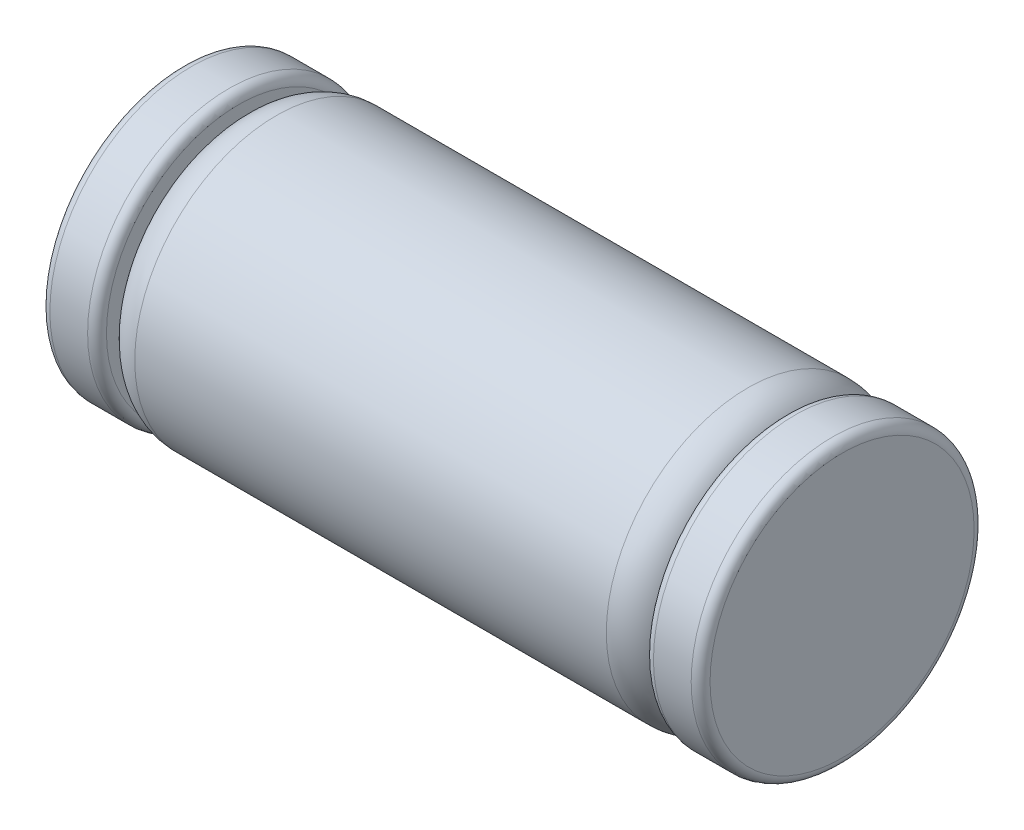
ISO-10303-21;
HEADER;
FILE_DESCRIPTION(('STEP AP214'),'2;1');
FILE_NAME('part.step','',(''),(''),'','','');
FILE_SCHEMA(('AUTOMOTIVE_DESIGN { 1 0 10303 214 1 1 1 1 }'));
ENDSEC;
DATA;
#1=APPLICATION_CONTEXT('core data for automotive mechanical design processes');
#2=APPLICATION_PROTOCOL_DEFINITION('international standard','automotive_design',2000,#1);
#3=PRODUCT_CONTEXT('',#1,'mechanical');
#4=PRODUCT('Part','Part','',(#3));
#5=PRODUCT_RELATED_PRODUCT_CATEGORY('part','',(#4));
#6=PRODUCT_DEFINITION_FORMATION('','',#4);
#7=PRODUCT_DEFINITION_CONTEXT('part definition',#1,'design');
#8=PRODUCT_DEFINITION('design','',#6,#7);
#9=PRODUCT_DEFINITION_SHAPE('','',#8);
#10=(LENGTH_UNIT() NAMED_UNIT(*) SI_UNIT(.MILLI.,.METRE.));
#11=(NAMED_UNIT(*) PLANE_ANGLE_UNIT() SI_UNIT($,.RADIAN.));
#12=(NAMED_UNIT(*) SI_UNIT($,.STERADIAN.) SOLID_ANGLE_UNIT());
#13=UNCERTAINTY_MEASURE_WITH_UNIT(LENGTH_MEASURE(1.E-05),#10,'distance_accuracy_value','');
#14=(GEOMETRIC_REPRESENTATION_CONTEXT(3) GLOBAL_UNCERTAINTY_ASSIGNED_CONTEXT((#13)) GLOBAL_UNIT_ASSIGNED_CONTEXT((#10,
#11,#12)) REPRESENTATION_CONTEXT('',''));
#15=CARTESIAN_POINT('',(0.,0.,0.));
#16=DIRECTION('',(0.,0.,1.));
#17=DIRECTION('',(1.,0.,0.));
#18=AXIS2_PLACEMENT_3D('',#15,#16,#17);
#19=CARTESIAN_POINT('',(-1.75,0.,0.));
#20=DIRECTION('',(-1.,0.,0.));
#21=DIRECTION('',(0.,0.,1.));
#22=AXIS2_PLACEMENT_3D('',#19,#20,#21);
#23=PLANE('',#22);
#24=CARTESIAN_POINT('',(-1.75,0.,0.));
#25=DIRECTION('',(1.,0.,0.));
#26=DIRECTION('',(0.,0.,-1.));
#27=AXIS2_PLACEMENT_3D('',#24,#25,#26);
#28=CIRCLE('',#27,0.7);
#29=CARTESIAN_POINT('',(-1.75,0.,-0.7));
#30=VERTEX_POINT('',#29);
#31=CARTESIAN_POINT('',(-1.75,0.,0.7));
#32=VERTEX_POINT('',#31);
#33=EDGE_CURVE('E70',#30,#32,#28,.T.);
#34=ORIENTED_EDGE('',*,*,#33,.F.);
#35=CARTESIAN_POINT('',(-1.75,0.,0.));
#36=DIRECTION('',(1.,0.,0.));
#37=DIRECTION('',(0.,0.,1.));
#38=AXIS2_PLACEMENT_3D('',#35,#36,#37);
#39=CIRCLE('',#38,0.7);
#40=EDGE_CURVE('E74',#32,#30,#39,.T.);
#41=ORIENTED_EDGE('',*,*,#40,.F.);
#42=EDGE_LOOP('',(#34,#41));
#43=FACE_BOUND('',#42,.T.);
#44=ADVANCED_FACE('F17',(#43),#23,.T.);
#45=CARTESIAN_POINT('',(1.75,0.,0.));
#46=DIRECTION('',(1.,0.,0.));
#47=DIRECTION('',(0.,0.,-1.));
#48=AXIS2_PLACEMENT_3D('',#45,#46,#47);
#49=PLANE('',#48);
#50=CARTESIAN_POINT('',(1.75,0.,0.));
#51=DIRECTION('',(-1.,0.,0.));
#52=DIRECTION('',(0.,0.,1.));
#53=AXIS2_PLACEMENT_3D('',#50,#51,#52);
#54=CIRCLE('',#53,0.7);
#55=CARTESIAN_POINT('',(1.75,0.,0.7));
#56=VERTEX_POINT('',#55);
#57=CARTESIAN_POINT('',(1.75,0.,-0.7));
#58=VERTEX_POINT('',#57);
#59=EDGE_CURVE('E80',#56,#58,#54,.T.);
#60=ORIENTED_EDGE('',*,*,#59,.F.);
#61=CARTESIAN_POINT('',(1.75,0.,0.));
#62=DIRECTION('',(-1.,0.,0.));
#63=DIRECTION('',(0.,0.,-1.));
#64=AXIS2_PLACEMENT_3D('',#61,#62,#63);
#65=CIRCLE('',#64,0.7);
#66=EDGE_CURVE('E114',#58,#56,#65,.T.);
#67=ORIENTED_EDGE('',*,*,#66,.F.);
#68=EDGE_LOOP('',(#60,#67));
#69=FACE_BOUND('',#68,.T.);
#70=ADVANCED_FACE('F99',(#69),#49,.T.);
#71=CARTESIAN_POINT('',(-1.7,0.,0.));
#72=DIRECTION('',(-1.,0.,0.));
#73=DIRECTION('',(0.,0.,1.));
#74=AXIS2_PLACEMENT_3D('',#71,#72,#73);
#75=TOROIDAL_SURFACE('',#74,0.7,0.05);
#76=CARTESIAN_POINT('',(-1.7,0.,0.));
#77=DIRECTION('',(-1.,0.,0.));
#78=DIRECTION('',(0.,0.,1.));
#79=AXIS2_PLACEMENT_3D('',#76,#77,#78);
#80=CIRCLE('',#79,0.75);
#81=CARTESIAN_POINT('',(-1.7,0.,0.75));
#82=VERTEX_POINT('',#81);
#83=EDGE_CURVE('E110',#82,#82,#80,.F.);
#84=ORIENTED_EDGE('',*,*,#83,.F.);
#85=EDGE_LOOP('',(#84));
#86=FACE_BOUND('',#85,.T.);
#87=ORIENTED_EDGE('',*,*,#40,.T.);
#88=ORIENTED_EDGE('',*,*,#33,.T.);
#89=EDGE_LOOP('',(#87,#88));
#90=FACE_BOUND('',#89,.T.);
#91=ADVANCED_FACE('F79',(#86,#90),#75,.T.);
#92=CARTESIAN_POINT('',(1.7,0.,0.));
#93=DIRECTION('',(-1.,0.,0.));
#94=DIRECTION('',(0.,0.,1.));
#95=AXIS2_PLACEMENT_3D('',#92,#93,#94);
#96=TOROIDAL_SURFACE('',#95,0.7,0.05);
#97=ORIENTED_EDGE('',*,*,#59,.T.);
#98=ORIENTED_EDGE('',*,*,#66,.T.);
#99=EDGE_LOOP('',(#97,#98));
#100=FACE_BOUND('',#99,.T.);
#101=CARTESIAN_POINT('',(1.7,0.,0.));
#102=DIRECTION('',(-1.,0.,0.));
#103=DIRECTION('',(0.,0.,1.));
#104=AXIS2_PLACEMENT_3D('',#101,#102,#103);
#105=CIRCLE('',#104,0.75);
#106=CARTESIAN_POINT('',(1.7,0.,0.75));
#107=VERTEX_POINT('',#106);
#108=EDGE_CURVE('E113',#107,#107,#105,.T.);
#109=ORIENTED_EDGE('',*,*,#108,.F.);
#110=EDGE_LOOP('',(#109));
#111=FACE_BOUND('',#110,.T.);
#112=ADVANCED_FACE('F98',(#100,#111),#96,.T.);
#113=CARTESIAN_POINT('',(-1.75,0.,0.));
#114=DIRECTION('',(-1.,0.,0.));
#115=DIRECTION('',(0.,0.,1.));
#116=AXIS2_PLACEMENT_3D('',#113,#114,#115);
#117=CYLINDRICAL_SURFACE('',#116,0.75);
#118=CARTESIAN_POINT('',(-1.5,0.,0.));
#119=DIRECTION('',(-1.,0.,0.));
#120=DIRECTION('',(0.,0.,1.));
#121=AXIS2_PLACEMENT_3D('',#118,#119,#120);
#122=CIRCLE('',#121,0.75);
#123=CARTESIAN_POINT('',(-1.5,0.,0.75));
#124=VERTEX_POINT('',#123);
#125=EDGE_CURVE('E197',#124,#124,#122,.F.);
#126=ORIENTED_EDGE('',*,*,#125,.F.);
#127=EDGE_LOOP('',(#126));
#128=FACE_BOUND('',#127,.T.);
#129=ORIENTED_EDGE('',*,*,#83,.T.);
#130=EDGE_LOOP('',(#129));
#131=FACE_BOUND('',#130,.T.);
#132=ADVANCED_FACE('F207',(#128,#131),#117,.T.);
#133=CARTESIAN_POINT('',(-1.75,0.,0.));
#134=DIRECTION('',(-1.,0.,0.));
#135=DIRECTION('',(0.,0.,1.));
#136=AXIS2_PLACEMENT_3D('',#133,#134,#135);
#137=CYLINDRICAL_SURFACE('',#136,0.75);
#138=ORIENTED_EDGE('',*,*,#108,.T.);
#139=EDGE_LOOP('',(#138));
#140=FACE_BOUND('',#139,.T.);
#141=CARTESIAN_POINT('',(1.5,0.,0.));
#142=DIRECTION('',(-1.,0.,0.));
#143=DIRECTION('',(0.,0.,1.));
#144=AXIS2_PLACEMENT_3D('',#141,#142,#143);
#145=CIRCLE('',#144,0.75);
#146=CARTESIAN_POINT('',(1.5,0.,0.75));
#147=VERTEX_POINT('',#146);
#148=EDGE_CURVE('E188',#147,#147,#145,.T.);
#149=ORIENTED_EDGE('',*,*,#148,.F.);
#150=EDGE_LOOP('',(#149));
#151=FACE_BOUND('',#150,.T.);
#152=ADVANCED_FACE('F172',(#140,#151),#137,.T.);
#153=CARTESIAN_POINT('',(-1.5,0.,0.));
#154=DIRECTION('',(-1.,0.,0.));
#155=DIRECTION('',(0.,0.,1.));
#156=AXIS2_PLACEMENT_3D('',#153,#154,#155);
#157=TOROIDAL_SURFACE('',#156,0.7,0.05);
#158=CARTESIAN_POINT('',(-1.45,0.,0.));
#159=DIRECTION('',(-1.,0.,0.));
#160=DIRECTION('',(0.,0.,1.));
#161=AXIS2_PLACEMENT_3D('',#158,#159,#160);
#162=CIRCLE('',#161,0.7);
#163=CARTESIAN_POINT('',(-1.45,0.,-0.7));
#164=VERTEX_POINT('',#163);
#165=CARTESIAN_POINT('',(-1.45,0.,0.7));
#166=VERTEX_POINT('',#165);
#167=EDGE_CURVE('E311',#164,#166,#162,.F.);
#168=ORIENTED_EDGE('',*,*,#167,.F.);
#169=CARTESIAN_POINT('',(-1.45,0.,0.));
#170=DIRECTION('',(-1.,0.,0.));
#171=DIRECTION('',(0.,0.,-1.));
#172=AXIS2_PLACEMENT_3D('',#169,#170,#171);
#173=CIRCLE('',#172,0.7);
#174=EDGE_CURVE('E183',#166,#164,#173,.F.);
#175=ORIENTED_EDGE('',*,*,#174,.F.);
#176=EDGE_LOOP('',(#168,#175));
#177=FACE_BOUND('',#176,.T.);
#178=ORIENTED_EDGE('',*,*,#125,.T.);
#179=EDGE_LOOP('',(#178));
#180=FACE_BOUND('',#179,.T.);
#181=ADVANCED_FACE('F160',(#177,#180),#157,.T.);
#182=CARTESIAN_POINT('',(1.5,0.,0.));
#183=DIRECTION('',(-1.,0.,0.));
#184=DIRECTION('',(0.,0.,1.));
#185=AXIS2_PLACEMENT_3D('',#182,#183,#184);
#186=TOROIDAL_SURFACE('',#185,0.7,0.05);
#187=ORIENTED_EDGE('',*,*,#148,.T.);
#188=EDGE_LOOP('',(#187));
#189=FACE_BOUND('',#188,.T.);
#190=CARTESIAN_POINT('',(1.45,0.,0.));
#191=DIRECTION('',(1.,0.,0.));
#192=DIRECTION('',(0.,0.,1.));
#193=AXIS2_PLACEMENT_3D('',#190,#191,#192);
#194=CIRCLE('',#193,0.7);
#195=CARTESIAN_POINT('',(1.45,0.,-0.7));
#196=VERTEX_POINT('',#195);
#197=CARTESIAN_POINT('',(1.45,0.,0.7));
#198=VERTEX_POINT('',#197);
#199=EDGE_CURVE('E341',#196,#198,#194,.F.);
#200=ORIENTED_EDGE('',*,*,#199,.F.);
#201=CARTESIAN_POINT('',(1.45,0.,0.));
#202=DIRECTION('',(1.,0.,0.));
#203=DIRECTION('',(0.,0.,-1.));
#204=AXIS2_PLACEMENT_3D('',#201,#202,#203);
#205=CIRCLE('',#204,0.7);
#206=EDGE_CURVE('E240',#198,#196,#205,.F.);
#207=ORIENTED_EDGE('',*,*,#206,.F.);
#208=EDGE_LOOP('',(#200,#207));
#209=FACE_BOUND('',#208,.T.);
#210=ADVANCED_FACE('F171',(#189,#209),#186,.T.);
#211=CARTESIAN_POINT('',(-1.45,-0.7,0.));
#212=DIRECTION('',(1.,0.,0.));
#213=DIRECTION('',(0.,0.,-1.));
#214=AXIS2_PLACEMENT_3D('',#211,#212,#213);
#215=PLANE('',#214);
#216=ORIENTED_EDGE('',*,*,#167,.T.);
#217=ORIENTED_EDGE('',*,*,#174,.T.);
#218=EDGE_LOOP('',(#216,#217));
#219=FACE_BOUND('',#218,.T.);
#220=CARTESIAN_POINT('',(-1.45,0.,0.));
#221=DIRECTION('',(1.,0.,0.));
#222=DIRECTION('',(0.,0.,-1.));
#223=AXIS2_PLACEMENT_3D('',#220,#221,#222);
#224=CIRCLE('',#223,0.55);
#225=CARTESIAN_POINT('',(-1.45,0.,0.55));
#226=VERTEX_POINT('',#225);
#227=CARTESIAN_POINT('',(-1.45,0.,-0.55));
#228=VERTEX_POINT('',#227);
#229=EDGE_CURVE('E196',#226,#228,#224,.F.);
#230=ORIENTED_EDGE('',*,*,#229,.T.);
#231=CARTESIAN_POINT('',(-1.45,0.,0.));
#232=DIRECTION('',(1.,0.,0.));
#233=DIRECTION('',(0.,0.,1.));
#234=AXIS2_PLACEMENT_3D('',#231,#232,#233);
#235=CIRCLE('',#234,0.55);
#236=EDGE_CURVE('E300',#226,#228,#235,.T.);
#237=ORIENTED_EDGE('',*,*,#236,.F.);
#238=EDGE_LOOP('',(#230,#237));
#239=FACE_BOUND('',#238,.T.);
#240=ADVANCED_FACE('F253',(#219,#239),#215,.T.);
#241=CARTESIAN_POINT('',(1.45,-0.7,0.));
#242=DIRECTION('',(-1.,0.,0.));
#243=DIRECTION('',(0.,0.,1.));
#244=AXIS2_PLACEMENT_3D('',#241,#242,#243);
#245=PLANE('',#244);
#246=CARTESIAN_POINT('',(1.45,0.,0.));
#247=DIRECTION('',(-1.,0.,0.));
#248=DIRECTION('',(0.,0.,1.));
#249=AXIS2_PLACEMENT_3D('',#246,#247,#248);
#250=CIRCLE('',#249,0.55);
#251=CARTESIAN_POINT('',(1.45,0.,-0.55));
#252=VERTEX_POINT('',#251);
#253=CARTESIAN_POINT('',(1.45,0.,0.55));
#254=VERTEX_POINT('',#253);
#255=EDGE_CURVE('E37',#252,#254,#250,.F.);
#256=ORIENTED_EDGE('',*,*,#255,.T.);
#257=CARTESIAN_POINT('',(1.45,0.,0.));
#258=DIRECTION('',(-1.,0.,0.));
#259=DIRECTION('',(0.,0.,-1.));
#260=AXIS2_PLACEMENT_3D('',#257,#258,#259);
#261=CIRCLE('',#260,0.55);
#262=EDGE_CURVE('E200',#252,#254,#261,.T.);
#263=ORIENTED_EDGE('',*,*,#262,.F.);
#264=EDGE_LOOP('',(#256,#263));
#265=FACE_BOUND('',#264,.T.);
#266=ORIENTED_EDGE('',*,*,#206,.T.);
#267=ORIENTED_EDGE('',*,*,#199,.T.);
#268=EDGE_LOOP('',(#266,#267));
#269=FACE_BOUND('',#268,.T.);
#270=ADVANCED_FACE('F245',(#265,#269),#245,.T.);
#271=CARTESIAN_POINT('',(-1.25,0.,0.));
#272=DIRECTION('',(-1.,0.,0.));
#273=DIRECTION('',(0.,0.,1.));
#274=AXIS2_PLACEMENT_3D('',#271,#272,#273);
#275=TOROIDAL_SURFACE('',#274,0.55,0.2);
#276=ORIENTED_EDGE('',*,*,#236,.T.);
#277=ORIENTED_EDGE('',*,*,#229,.F.);
#278=EDGE_LOOP('',(#276,#277));
#279=FACE_BOUND('',#278,.T.);
#280=CARTESIAN_POINT('',(-1.25,0.,0.));
#281=DIRECTION('',(-1.,0.,0.));
#282=DIRECTION('',(0.,0.,1.));
#283=AXIS2_PLACEMENT_3D('',#280,#281,#282);
#284=CIRCLE('',#283,0.75);
#285=CARTESIAN_POINT('',(-1.25,0.,0.75));
#286=VERTEX_POINT('',#285);
#287=EDGE_CURVE('E29',#286,#286,#284,.F.);
#288=ORIENTED_EDGE('',*,*,#287,.F.);
#289=EDGE_LOOP('',(#288));
#290=FACE_BOUND('',#289,.T.);
#291=ADVANCED_FACE('F221',(#279,#290),#275,.T.);
#292=CARTESIAN_POINT('',(1.25,0.,0.));
#293=DIRECTION('',(-1.,0.,0.));
#294=DIRECTION('',(0.,0.,1.));
#295=AXIS2_PLACEMENT_3D('',#292,#293,#294);
#296=TOROIDAL_SURFACE('',#295,0.55,0.2);
#297=CARTESIAN_POINT('',(1.25,0.,0.));
#298=DIRECTION('',(-1.,0.,0.));
#299=DIRECTION('',(0.,0.,1.));
#300=AXIS2_PLACEMENT_3D('',#297,#298,#299);
#301=CIRCLE('',#300,0.75);
#302=CARTESIAN_POINT('',(1.25,0.,0.75));
#303=VERTEX_POINT('',#302);
#304=EDGE_CURVE('E11',#303,#303,#301,.T.);
#305=ORIENTED_EDGE('',*,*,#304,.F.);
#306=EDGE_LOOP('',(#305));
#307=FACE_BOUND('',#306,.T.);
#308=ORIENTED_EDGE('',*,*,#262,.T.);
#309=ORIENTED_EDGE('',*,*,#255,.F.);
#310=EDGE_LOOP('',(#308,#309));
#311=FACE_BOUND('',#310,.T.);
#312=ADVANCED_FACE('F215',(#307,#311),#296,.T.);
#313=CARTESIAN_POINT('',(-1.75,0.,0.));
#314=DIRECTION('',(-1.,0.,0.));
#315=DIRECTION('',(0.,0.,1.));
#316=AXIS2_PLACEMENT_3D('',#313,#314,#315);
#317=CYLINDRICAL_SURFACE('',#316,0.75);
#318=ORIENTED_EDGE('',*,*,#287,.T.);
#319=EDGE_LOOP('',(#318));
#320=FACE_BOUND('',#319,.T.);
#321=ORIENTED_EDGE('',*,*,#304,.T.);
#322=EDGE_LOOP('',(#321));
#323=FACE_BOUND('',#322,.T.);
#324=ADVANCED_FACE('F213',(#320,#323),#317,.T.);
#325=CLOSED_SHELL('',(#44,#70,#91,#112,#132,#152,#181,#210,#240,#270,#291,#312,#324));
#326=MANIFOLD_SOLID_BREP('B1',#325);
#327=ADVANCED_BREP_SHAPE_REPRESENTATION('',(#18,#326),#14);
#328=SHAPE_DEFINITION_REPRESENTATION(#9,#327);
ENDSEC;
END-ISO-10303-21;
